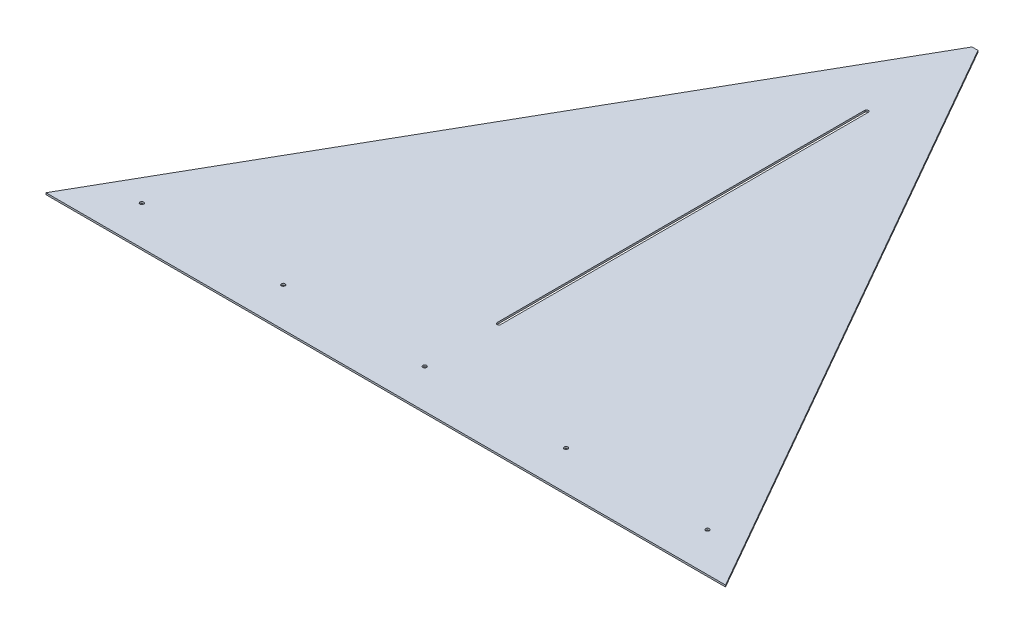
ISO-10303-21;
HEADER;
FILE_DESCRIPTION(('STEP AP214'),'2;1');
FILE_NAME('part.step','',(''),(''),'','','');
FILE_SCHEMA(('AUTOMOTIVE_DESIGN { 1 0 10303 214 1 1 1 1 }'));
ENDSEC;
DATA;
#1=APPLICATION_CONTEXT('core data for automotive mechanical design processes');
#2=APPLICATION_PROTOCOL_DEFINITION('international standard','automotive_design',2000,#1);
#3=PRODUCT_CONTEXT('',#1,'mechanical');
#4=PRODUCT('Part','Part','',(#3));
#5=PRODUCT_RELATED_PRODUCT_CATEGORY('part','',(#4));
#6=PRODUCT_DEFINITION_FORMATION('','',#4);
#7=PRODUCT_DEFINITION_CONTEXT('part definition',#1,'design');
#8=PRODUCT_DEFINITION('design','',#6,#7);
#9=PRODUCT_DEFINITION_SHAPE('','',#8);
#10=(LENGTH_UNIT() NAMED_UNIT(*) SI_UNIT(.MILLI.,.METRE.));
#11=(NAMED_UNIT(*) PLANE_ANGLE_UNIT() SI_UNIT($,.RADIAN.));
#12=(NAMED_UNIT(*) SI_UNIT($,.STERADIAN.) SOLID_ANGLE_UNIT());
#13=UNCERTAINTY_MEASURE_WITH_UNIT(LENGTH_MEASURE(1.E-05),#10,'distance_accuracy_value','');
#14=(GEOMETRIC_REPRESENTATION_CONTEXT(3) GLOBAL_UNCERTAINTY_ASSIGNED_CONTEXT((#13)) GLOBAL_UNIT_ASSIGNED_CONTEXT((#10,
#11,#12)) REPRESENTATION_CONTEXT('',''));
#15=CARTESIAN_POINT('',(0.,0.,0.));
#16=DIRECTION('',(0.,0.,1.));
#17=DIRECTION('',(1.,0.,0.));
#18=AXIS2_PLACEMENT_3D('',#15,#16,#17);
#19=CARTESIAN_POINT('',(0.,0.,0.));
#20=DIRECTION('',(0.,1.,0.));
#21=DIRECTION('',(0.,0.,1.));
#22=AXIS2_PLACEMENT_3D('',#19,#20,#21);
#23=PLANE('',#22);
#24=CARTESIAN_POINT('',(508.,0.,988.656429313362));
#25=DIRECTION('',(0.,1.,0.));
#26=DIRECTION('',(0.,0.,1.));
#27=AXIS2_PLACEMENT_3D('',#24,#25,#26);
#28=CIRCLE('',#27,3.3655);
#29=CARTESIAN_POINT('',(508.,0.,992.021929313362));
#30=VERTEX_POINT('',#29);
#31=EDGE_CURVE('E133',#30,#30,#28,.T.);
#32=ORIENTED_EDGE('',*,*,#31,.T.);
#33=EDGE_LOOP('',(#32));
#34=FACE_BOUND('',#33,.T.);
#35=CARTESIAN_POINT('',(254.,0.,988.656429313362));
#36=DIRECTION('',(0.,1.,0.));
#37=DIRECTION('',(0.,0.,1.));
#38=AXIS2_PLACEMENT_3D('',#35,#36,#37);
#39=CIRCLE('',#38,3.3655);
#40=CARTESIAN_POINT('',(254.,0.,992.021929313362));
#41=VERTEX_POINT('',#40);
#42=EDGE_CURVE('E137',#41,#41,#39,.T.);
#43=ORIENTED_EDGE('',*,*,#42,.T.);
#44=EDGE_LOOP('',(#43));
#45=FACE_BOUND('',#44,.T.);
#46=CARTESIAN_POINT('',(-508.,0.,988.656429313362));
#47=DIRECTION('',(0.,1.,0.));
#48=DIRECTION('',(0.,0.,1.));
#49=AXIS2_PLACEMENT_3D('',#46,#47,#48);
#50=CIRCLE('',#49,3.3655);
#51=CARTESIAN_POINT('',(-508.,0.,992.021929313362));
#52=VERTEX_POINT('',#51);
#53=EDGE_CURVE('E140',#52,#52,#50,.T.);
#54=ORIENTED_EDGE('',*,*,#53,.T.);
#55=EDGE_LOOP('',(#54));
#56=FACE_BOUND('',#55,.T.);
#57=CARTESIAN_POINT('',(-254.,0.,988.656429313362));
#58=DIRECTION('',(0.,1.,0.));
#59=DIRECTION('',(0.,0.,1.));
#60=AXIS2_PLACEMENT_3D('',#57,#58,#59);
#61=CIRCLE('',#60,3.3655);
#62=CARTESIAN_POINT('',(-254.,0.,992.021929313362));
#63=VERTEX_POINT('',#62);
#64=EDGE_CURVE('E143',#63,#63,#61,.T.);
#65=ORIENTED_EDGE('',*,*,#64,.T.);
#66=EDGE_LOOP('',(#65));
#67=FACE_BOUND('',#66,.T.);
#68=CARTESIAN_POINT('',(0.,0.,988.656429313362));
#69=DIRECTION('',(0.,1.,0.));
#70=DIRECTION('',(0.,0.,1.));
#71=AXIS2_PLACEMENT_3D('',#68,#69,#70);
#72=CIRCLE('',#71,3.3655);
#73=CARTESIAN_POINT('',(0.,0.,992.021929313362));
#74=VERTEX_POINT('',#73);
#75=EDGE_CURVE('E146',#74,#74,#72,.T.);
#76=ORIENTED_EDGE('',*,*,#75,.T.);
#77=EDGE_LOOP('',(#76));
#78=FACE_BOUND('',#77,.T.);
#79=DIRECTION('',(0.,0.,-1.));
#80=VECTOR('',#79,1.);
#81=CARTESIAN_POINT('',(3.175,0.,855.306429313362));
#82=LINE('',#81,#80);
#83=CARTESIAN_POINT('',(3.175,0.,855.306429313362));
#84=VERTEX_POINT('',#83);
#85=CARTESIAN_POINT('',(3.175,0.,194.906429313489));
#86=VERTEX_POINT('',#85);
#87=EDGE_CURVE('E60',#84,#86,#82,.T.);
#88=ORIENTED_EDGE('',*,*,#87,.T.);
#89=CARTESIAN_POINT('',(0.,0.,194.906429313489));
#90=DIRECTION('',(0.,1.,0.));
#91=DIRECTION('',(0.,0.,1.));
#92=AXIS2_PLACEMENT_3D('',#89,#90,#91);
#93=CIRCLE('',#92,3.175);
#94=CARTESIAN_POINT('',(-3.175,0.,194.906429313489));
#95=VERTEX_POINT('',#94);
#96=EDGE_CURVE('E20',#86,#95,#93,.T.);
#97=ORIENTED_EDGE('',*,*,#96,.T.);
#98=DIRECTION('',(0.,0.,1.));
#99=VECTOR('',#98,1.);
#100=CARTESIAN_POINT('',(-3.175,0.,194.906429313489));
#101=LINE('',#100,#99);
#102=CARTESIAN_POINT('',(-3.175,0.,855.306429313362));
#103=VERTEX_POINT('',#102);
#104=EDGE_CURVE('E108',#95,#103,#101,.T.);
#105=ORIENTED_EDGE('',*,*,#104,.T.);
#106=CARTESIAN_POINT('',(0.,0.,855.306429313362));
#107=DIRECTION('',(0.,1.,0.));
#108=DIRECTION('',(0.,0.,1.));
#109=AXIS2_PLACEMENT_3D('',#106,#107,#108);
#110=CIRCLE('',#109,3.175);
#111=EDGE_CURVE('E149',#103,#84,#110,.T.);
#112=ORIENTED_EDGE('',*,*,#111,.T.);
#113=EDGE_LOOP('',(#88,#97,#105,#112));
#114=FACE_BOUND('',#113,.T.);
#115=DIRECTION('',(-0.496218749999998,0.,-0.868197530604896));
#116=VECTOR('',#115,1.);
#117=CARTESIAN_POINT('',(610.3239,0.,1058.50642931336));
#118=LINE('',#117,#116);
#119=CARTESIAN_POINT('',(610.3239,0.,1058.50642931336));
#120=VERTEX_POINT('',#119);
#121=CARTESIAN_POINT('',(5.33400000002841,0.,-1.64868119156836E-11));
#122=VERTEX_POINT('',#121);
#123=EDGE_CURVE('E96',#120,#122,#118,.T.);
#124=ORIENTED_EDGE('',*,*,#123,.F.);
#125=DIRECTION('',(1.,0.,0.));
#126=VECTOR('',#125,1.);
#127=CARTESIAN_POINT('',(-610.3239,0.,1058.50642931336));
#128=LINE('',#127,#126);
#129=CARTESIAN_POINT('',(-610.323899999986,0.,1058.50642931337));
#130=VERTEX_POINT('',#129);
#131=EDGE_CURVE('E84',#130,#120,#128,.T.);
#132=ORIENTED_EDGE('',*,*,#131,.F.);
#133=DIRECTION('',(-0.496218749999998,0.,0.868197530604896));
#134=VECTOR('',#133,1.);
#135=CARTESIAN_POINT('',(-5.334,0.,0.));
#136=LINE('',#135,#134);
#137=CARTESIAN_POINT('',(-5.334,0.,0.));
#138=VERTEX_POINT('',#137);
#139=EDGE_CURVE('E157',#138,#130,#136,.T.);
#140=ORIENTED_EDGE('',*,*,#139,.F.);
#141=DIRECTION('',(-1.,0.,0.));
#142=VECTOR('',#141,1.);
#143=CARTESIAN_POINT('',(5.334,0.,0.));
#144=LINE('',#143,#142);
#145=EDGE_CURVE('E69',#122,#138,#144,.T.);
#146=ORIENTED_EDGE('',*,*,#145,.F.);
#147=EDGE_LOOP('',(#124,#132,#140,#146));
#148=FACE_BOUND('',#147,.T.);
#149=ADVANCED_FACE('F17',(#34,#45,#56,#67,#78,#114,#148),#23,.F.);
#150=CARTESIAN_POINT('',(-610.3239,0.,1058.50642931336));
#151=DIRECTION('',(0.,0.,1.));
#152=DIRECTION('',(1.,0.,0.));
#153=AXIS2_PLACEMENT_3D('',#150,#151,#152);
#154=PLANE('',#153);
#155=DIRECTION('',(0.,1.,0.));
#156=VECTOR('',#155,1.);
#157=CARTESIAN_POINT('',(-610.323899999943,0.,1058.50642931339));
#158=LINE('',#157,#156);
#159=CARTESIAN_POINT('',(-610.323899999986,3.175,1058.50642931337));
#160=VERTEX_POINT('',#159);
#161=EDGE_CURVE('E92',#130,#160,#158,.T.);
#162=ORIENTED_EDGE('',*,*,#161,.F.);
#163=ORIENTED_EDGE('',*,*,#131,.T.);
#164=DIRECTION('',(0.,1.,0.));
#165=VECTOR('',#164,1.);
#166=CARTESIAN_POINT('',(610.3239,0.,1058.50642931336));
#167=LINE('',#166,#165);
#168=CARTESIAN_POINT('',(610.3239,3.175,1058.50642931336));
#169=VERTEX_POINT('',#168);
#170=EDGE_CURVE('E89',#169,#120,#167,.F.);
#171=ORIENTED_EDGE('',*,*,#170,.F.);
#172=DIRECTION('',(1.,0.,0.));
#173=VECTOR('',#172,1.);
#174=CARTESIAN_POINT('',(0.,3.175,1058.50642931336));
#175=LINE('',#174,#173);
#176=EDGE_CURVE('E136',#160,#169,#175,.T.);
#177=ORIENTED_EDGE('',*,*,#176,.F.);
#178=EDGE_LOOP('',(#162,#163,#171,#177));
#179=FACE_BOUND('',#178,.T.);
#180=ADVANCED_FACE('F86',(#179),#154,.T.);
#181=CARTESIAN_POINT('',(610.3239,0.,1058.50642931336));
#182=DIRECTION('',(0.868197530604896,0.,-0.496218749999998));
#183=DIRECTION('',(-0.496218749999998,0.,-0.868197530604896));
#184=AXIS2_PLACEMENT_3D('',#181,#182,#183);
#185=PLANE('',#184);
#186=ORIENTED_EDGE('',*,*,#170,.T.);
#187=ORIENTED_EDGE('',*,*,#123,.T.);
#188=DIRECTION('',(0.,1.,0.));
#189=VECTOR('',#188,1.);
#190=CARTESIAN_POINT('',(5.334,0.,0.));
#191=LINE('',#190,#189);
#192=CARTESIAN_POINT('',(5.33400000002841,3.175,-1.64868119156836E-11));
#193=VERTEX_POINT('',#192);
#194=EDGE_CURVE('E99',#193,#122,#191,.F.);
#195=ORIENTED_EDGE('',*,*,#194,.F.);
#196=DIRECTION('',(-0.496218750000045,0.,-0.86819753060487));
#197=VECTOR('',#196,1.);
#198=CARTESIAN_POINT('',(610.3239,3.175,1058.50642931336));
#199=LINE('',#198,#197);
#200=EDGE_CURVE('E103',#169,#193,#199,.T.);
#201=ORIENTED_EDGE('',*,*,#200,.F.);
#202=EDGE_LOOP('',(#186,#187,#195,#201));
#203=FACE_BOUND('',#202,.T.);
#204=ADVANCED_FACE('F101',(#203),#185,.T.);
#205=CARTESIAN_POINT('',(5.334,0.,0.));
#206=DIRECTION('',(0.,0.,-1.));
#207=DIRECTION('',(-1.,0.,0.));
#208=AXIS2_PLACEMENT_3D('',#205,#206,#207);
#209=PLANE('',#208);
#210=ORIENTED_EDGE('',*,*,#194,.T.);
#211=ORIENTED_EDGE('',*,*,#145,.T.);
#212=DIRECTION('',(0.,1.,0.));
#213=VECTOR('',#212,1.);
#214=CARTESIAN_POINT('',(-5.334,0.,0.));
#215=LINE('',#214,#213);
#216=CARTESIAN_POINT('',(-5.334,3.175,0.));
#217=VERTEX_POINT('',#216);
#218=EDGE_CURVE('E159',#217,#138,#215,.F.);
#219=ORIENTED_EDGE('',*,*,#218,.F.);
#220=DIRECTION('',(1.,0.,0.));
#221=VECTOR('',#220,1.);
#222=CARTESIAN_POINT('',(0.,3.175,0.));
#223=LINE('',#222,#221);
#224=EDGE_CURVE('E167',#193,#217,#223,.F.);
#225=ORIENTED_EDGE('',*,*,#224,.F.);
#226=EDGE_LOOP('',(#210,#211,#219,#225));
#227=FACE_BOUND('',#226,.T.);
#228=ADVANCED_FACE('F164',(#227),#209,.T.);
#229=CARTESIAN_POINT('',(-5.334,0.,0.));
#230=DIRECTION('',(-0.868197530604896,0.,-0.496218749999998));
#231=DIRECTION('',(-0.496218749999998,0.,0.868197530604896));
#232=AXIS2_PLACEMENT_3D('',#229,#230,#231);
#233=PLANE('',#232);
#234=ORIENTED_EDGE('',*,*,#218,.T.);
#235=ORIENTED_EDGE('',*,*,#139,.T.);
#236=ORIENTED_EDGE('',*,*,#161,.T.);
#237=DIRECTION('',(-0.496218750000045,0.,0.86819753060487));
#238=VECTOR('',#237,1.);
#239=CARTESIAN_POINT('',(-5.334,3.175,0.));
#240=LINE('',#239,#238);
#241=EDGE_CURVE('E132',#217,#160,#240,.T.);
#242=ORIENTED_EDGE('',*,*,#241,.F.);
#243=EDGE_LOOP('',(#234,#235,#236,#242));
#244=FACE_BOUND('',#243,.T.);
#245=ADVANCED_FACE('F175',(#244),#233,.T.);
#246=CARTESIAN_POINT('',(0.,3.175,194.906429313489));
#247=DIRECTION('',(0.,1.,0.));
#248=DIRECTION('',(0.,0.,1.));
#249=AXIS2_PLACEMENT_3D('',#246,#247,#248);
#250=CYLINDRICAL_SURFACE('',#249,3.175);
#251=CARTESIAN_POINT('',(0.,3.175,194.906429313489));
#252=DIRECTION('',(0.,1.,0.));
#253=DIRECTION('',(0.,0.,1.));
#254=AXIS2_PLACEMENT_3D('',#251,#252,#253);
#255=CIRCLE('',#254,3.175);
#256=CARTESIAN_POINT('',(-3.175,3.175,194.906429313489));
#257=VERTEX_POINT('',#256);
#258=CARTESIAN_POINT('',(3.175,3.175,194.906429313489));
#259=VERTEX_POINT('',#258);
#260=EDGE_CURVE('E129',#257,#259,#255,.F.);
#261=ORIENTED_EDGE('',*,*,#260,.F.);
#262=DIRECTION('',(0.,1.,0.));
#263=VECTOR('',#262,1.);
#264=CARTESIAN_POINT('',(-3.175,3.175,194.906429313489));
#265=LINE('',#264,#263);
#266=EDGE_CURVE('E148',#257,#95,#265,.F.);
#267=ORIENTED_EDGE('',*,*,#266,.T.);
#268=ORIENTED_EDGE('',*,*,#96,.F.);
#269=DIRECTION('',(0.,1.,0.));
#270=VECTOR('',#269,1.);
#271=CARTESIAN_POINT('',(3.175,3.175,194.906429313489));
#272=LINE('',#271,#270);
#273=EDGE_CURVE('E111',#86,#259,#272,.T.);
#274=ORIENTED_EDGE('',*,*,#273,.T.);
#275=EDGE_LOOP('',(#261,#267,#268,#274));
#276=FACE_BOUND('',#275,.T.);
#277=ADVANCED_FACE('F186',(#276),#250,.F.);
#278=CARTESIAN_POINT('',(3.175,3.175,855.306429313362));
#279=DIRECTION('',(1.,0.,0.));
#280=DIRECTION('',(0.,0.,-1.));
#281=AXIS2_PLACEMENT_3D('',#278,#279,#280);
#282=PLANE('',#281);
#283=DIRECTION('',(0.,0.,1.));
#284=VECTOR('',#283,1.);
#285=CARTESIAN_POINT('',(3.175,3.175,0.));
#286=LINE('',#285,#284);
#287=CARTESIAN_POINT('',(3.175,3.175,855.306429313362));
#288=VERTEX_POINT('',#287);
#289=EDGE_CURVE('E128',#259,#288,#286,.T.);
#290=ORIENTED_EDGE('',*,*,#289,.F.);
#291=ORIENTED_EDGE('',*,*,#273,.F.);
#292=ORIENTED_EDGE('',*,*,#87,.F.);
#293=DIRECTION('',(0.,1.,0.));
#294=VECTOR('',#293,1.);
#295=CARTESIAN_POINT('',(3.175,3.175,855.306429313362));
#296=LINE('',#295,#294);
#297=EDGE_CURVE('E110',#84,#288,#296,.T.);
#298=ORIENTED_EDGE('',*,*,#297,.T.);
#299=EDGE_LOOP('',(#290,#291,#292,#298));
#300=FACE_BOUND('',#299,.T.);
#301=ADVANCED_FACE('F194',(#300),#282,.F.);
#302=CARTESIAN_POINT('',(0.,3.175,855.306429313362));
#303=DIRECTION('',(0.,1.,0.));
#304=DIRECTION('',(0.,0.,1.));
#305=AXIS2_PLACEMENT_3D('',#302,#303,#304);
#306=CYLINDRICAL_SURFACE('',#305,3.175);
#307=CARTESIAN_POINT('',(0.,3.175,855.306429313362));
#308=DIRECTION('',(0.,1.,0.));
#309=DIRECTION('',(0.,0.,1.));
#310=AXIS2_PLACEMENT_3D('',#307,#308,#309);
#311=CIRCLE('',#310,3.175);
#312=CARTESIAN_POINT('',(-3.175,3.175,855.306429313362));
#313=VERTEX_POINT('',#312);
#314=EDGE_CURVE('E125',#288,#313,#311,.F.);
#315=ORIENTED_EDGE('',*,*,#314,.F.);
#316=ORIENTED_EDGE('',*,*,#297,.F.);
#317=ORIENTED_EDGE('',*,*,#111,.F.);
#318=DIRECTION('',(0.,1.,0.));
#319=VECTOR('',#318,1.);
#320=CARTESIAN_POINT('',(-3.175,3.175,855.306429313362));
#321=LINE('',#320,#319);
#322=EDGE_CURVE('E35',#103,#313,#321,.T.);
#323=ORIENTED_EDGE('',*,*,#322,.T.);
#324=EDGE_LOOP('',(#315,#316,#317,#323));
#325=FACE_BOUND('',#324,.T.);
#326=ADVANCED_FACE('F191',(#325),#306,.F.);
#327=CARTESIAN_POINT('',(-3.175,3.175,194.906429313489));
#328=DIRECTION('',(-1.,0.,0.));
#329=DIRECTION('',(0.,0.,1.));
#330=AXIS2_PLACEMENT_3D('',#327,#328,#329);
#331=PLANE('',#330);
#332=DIRECTION('',(0.,0.,1.));
#333=VECTOR('',#332,1.);
#334=CARTESIAN_POINT('',(-3.175,3.175,0.));
#335=LINE('',#334,#333);
#336=EDGE_CURVE('E124',#313,#257,#335,.F.);
#337=ORIENTED_EDGE('',*,*,#336,.F.);
#338=ORIENTED_EDGE('',*,*,#322,.F.);
#339=ORIENTED_EDGE('',*,*,#104,.F.);
#340=ORIENTED_EDGE('',*,*,#266,.F.);
#341=EDGE_LOOP('',(#337,#338,#339,#340));
#342=FACE_BOUND('',#341,.T.);
#343=ADVANCED_FACE('F189',(#342),#331,.F.);
#344=CARTESIAN_POINT('',(0.,3.175,988.656429313362));
#345=DIRECTION('',(0.,1.,0.));
#346=DIRECTION('',(0.,0.,1.));
#347=AXIS2_PLACEMENT_3D('',#344,#345,#346);
#348=CYLINDRICAL_SURFACE('',#347,3.3655);
#349=CARTESIAN_POINT('',(0.,3.175,988.656429313362));
#350=DIRECTION('',(0.,1.,0.));
#351=DIRECTION('',(0.,0.,1.));
#352=AXIS2_PLACEMENT_3D('',#349,#350,#351);
#353=CIRCLE('',#352,3.3655);
#354=CARTESIAN_POINT('',(0.,3.175,992.021929313362));
#355=VERTEX_POINT('',#354);
#356=EDGE_CURVE('E121',#355,#355,#353,.F.);
#357=ORIENTED_EDGE('',*,*,#356,.F.);
#358=EDGE_LOOP('',(#357));
#359=FACE_BOUND('',#358,.T.);
#360=ORIENTED_EDGE('',*,*,#75,.F.);
#361=EDGE_LOOP('',(#360));
#362=FACE_BOUND('',#361,.T.);
#363=ADVANCED_FACE('F219',(#359,#362),#348,.F.);
#364=CARTESIAN_POINT('',(-254.,3.175,988.656429313362));
#365=DIRECTION('',(0.,1.,0.));
#366=DIRECTION('',(0.,0.,1.));
#367=AXIS2_PLACEMENT_3D('',#364,#365,#366);
#368=CYLINDRICAL_SURFACE('',#367,3.3655);
#369=CARTESIAN_POINT('',(-254.,3.175,988.656429313362));
#370=DIRECTION('',(0.,1.,0.));
#371=DIRECTION('',(0.,0.,1.));
#372=AXIS2_PLACEMENT_3D('',#369,#370,#371);
#373=CIRCLE('',#372,3.3655);
#374=CARTESIAN_POINT('',(-254.,3.175,992.021929313362));
#375=VERTEX_POINT('',#374);
#376=EDGE_CURVE('E118',#375,#375,#373,.F.);
#377=ORIENTED_EDGE('',*,*,#376,.F.);
#378=EDGE_LOOP('',(#377));
#379=FACE_BOUND('',#378,.T.);
#380=ORIENTED_EDGE('',*,*,#64,.F.);
#381=EDGE_LOOP('',(#380));
#382=FACE_BOUND('',#381,.T.);
#383=ADVANCED_FACE('F215',(#379,#382),#368,.F.);
#384=CARTESIAN_POINT('',(-508.,3.175,988.656429313362));
#385=DIRECTION('',(0.,1.,0.));
#386=DIRECTION('',(0.,0.,1.));
#387=AXIS2_PLACEMENT_3D('',#384,#385,#386);
#388=CYLINDRICAL_SURFACE('',#387,3.3655);
#389=CARTESIAN_POINT('',(-508.,3.175,988.656429313362));
#390=DIRECTION('',(0.,1.,0.));
#391=DIRECTION('',(0.,0.,1.));
#392=AXIS2_PLACEMENT_3D('',#389,#390,#391);
#393=CIRCLE('',#392,3.3655);
#394=CARTESIAN_POINT('',(-508.,3.175,992.021929313362));
#395=VERTEX_POINT('',#394);
#396=EDGE_CURVE('E115',#395,#395,#393,.F.);
#397=ORIENTED_EDGE('',*,*,#396,.F.);
#398=EDGE_LOOP('',(#397));
#399=FACE_BOUND('',#398,.T.);
#400=ORIENTED_EDGE('',*,*,#53,.F.);
#401=EDGE_LOOP('',(#400));
#402=FACE_BOUND('',#401,.T.);
#403=ADVANCED_FACE('F211',(#399,#402),#388,.F.);
#404=CARTESIAN_POINT('',(254.,3.175,988.656429313362));
#405=DIRECTION('',(0.,1.,0.));
#406=DIRECTION('',(0.,0.,1.));
#407=AXIS2_PLACEMENT_3D('',#404,#405,#406);
#408=CYLINDRICAL_SURFACE('',#407,3.3655);
#409=CARTESIAN_POINT('',(254.,3.175,988.656429313362));
#410=DIRECTION('',(0.,1.,0.));
#411=DIRECTION('',(0.,0.,1.));
#412=AXIS2_PLACEMENT_3D('',#409,#410,#411);
#413=CIRCLE('',#412,3.3655);
#414=CARTESIAN_POINT('',(254.,3.175,992.021929313362));
#415=VERTEX_POINT('',#414);
#416=EDGE_CURVE('E26',#415,#415,#413,.F.);
#417=ORIENTED_EDGE('',*,*,#416,.F.);
#418=EDGE_LOOP('',(#417));
#419=FACE_BOUND('',#418,.T.);
#420=ORIENTED_EDGE('',*,*,#42,.F.);
#421=EDGE_LOOP('',(#420));
#422=FACE_BOUND('',#421,.T.);
#423=ADVANCED_FACE('F204',(#419,#422),#408,.F.);
#424=CARTESIAN_POINT('',(508.,3.175,988.656429313362));
#425=DIRECTION('',(0.,1.,0.));
#426=DIRECTION('',(0.,0.,1.));
#427=AXIS2_PLACEMENT_3D('',#424,#425,#426);
#428=CYLINDRICAL_SURFACE('',#427,3.3655);
#429=CARTESIAN_POINT('',(508.,3.175,988.656429313362));
#430=DIRECTION('',(0.,1.,0.));
#431=DIRECTION('',(0.,0.,1.));
#432=AXIS2_PLACEMENT_3D('',#429,#430,#431);
#433=CIRCLE('',#432,3.3655);
#434=CARTESIAN_POINT('',(508.,3.175,992.021929313362));
#435=VERTEX_POINT('',#434);
#436=EDGE_CURVE('E11',#435,#435,#433,.F.);
#437=ORIENTED_EDGE('',*,*,#436,.F.);
#438=EDGE_LOOP('',(#437));
#439=FACE_BOUND('',#438,.T.);
#440=ORIENTED_EDGE('',*,*,#31,.F.);
#441=EDGE_LOOP('',(#440));
#442=FACE_BOUND('',#441,.T.);
#443=ADVANCED_FACE('F197',(#439,#442),#428,.F.);
#444=CARTESIAN_POINT('',(0.,3.175,0.));
#445=DIRECTION('',(0.,1.,0.));
#446=DIRECTION('',(0.,0.,1.));
#447=AXIS2_PLACEMENT_3D('',#444,#445,#446);
#448=PLANE('',#447);
#449=ORIENTED_EDGE('',*,*,#436,.T.);
#450=EDGE_LOOP('',(#449));
#451=FACE_BOUND('',#450,.T.);
#452=ORIENTED_EDGE('',*,*,#416,.T.);
#453=EDGE_LOOP('',(#452));
#454=FACE_BOUND('',#453,.T.);
#455=ORIENTED_EDGE('',*,*,#396,.T.);
#456=EDGE_LOOP('',(#455));
#457=FACE_BOUND('',#456,.T.);
#458=ORIENTED_EDGE('',*,*,#376,.T.);
#459=EDGE_LOOP('',(#458));
#460=FACE_BOUND('',#459,.T.);
#461=ORIENTED_EDGE('',*,*,#356,.T.);
#462=EDGE_LOOP('',(#461));
#463=FACE_BOUND('',#462,.T.);
#464=ORIENTED_EDGE('',*,*,#314,.T.);
#465=ORIENTED_EDGE('',*,*,#336,.T.);
#466=ORIENTED_EDGE('',*,*,#260,.T.);
#467=ORIENTED_EDGE('',*,*,#289,.T.);
#468=EDGE_LOOP('',(#464,#465,#466,#467));
#469=FACE_BOUND('',#468,.T.);
#470=ORIENTED_EDGE('',*,*,#224,.T.);
#471=ORIENTED_EDGE('',*,*,#241,.T.);
#472=ORIENTED_EDGE('',*,*,#176,.T.);
#473=ORIENTED_EDGE('',*,*,#200,.T.);
#474=EDGE_LOOP('',(#470,#471,#472,#473));
#475=FACE_BOUND('',#474,.T.);
#476=ADVANCED_FACE('F176',(#451,#454,#457,#460,#463,#469,#475),#448,.T.);
#477=CLOSED_SHELL('',(#149,#180,#204,#228,#245,#277,#301,#326,#343,#363,#383,#403,#423,#443,#476));
#478=MANIFOLD_SOLID_BREP('B1',#477);
#479=ADVANCED_BREP_SHAPE_REPRESENTATION('',(#18,#478),#14);
#480=SHAPE_DEFINITION_REPRESENTATION(#9,#479);
ENDSEC;
END-ISO-10303-21;
